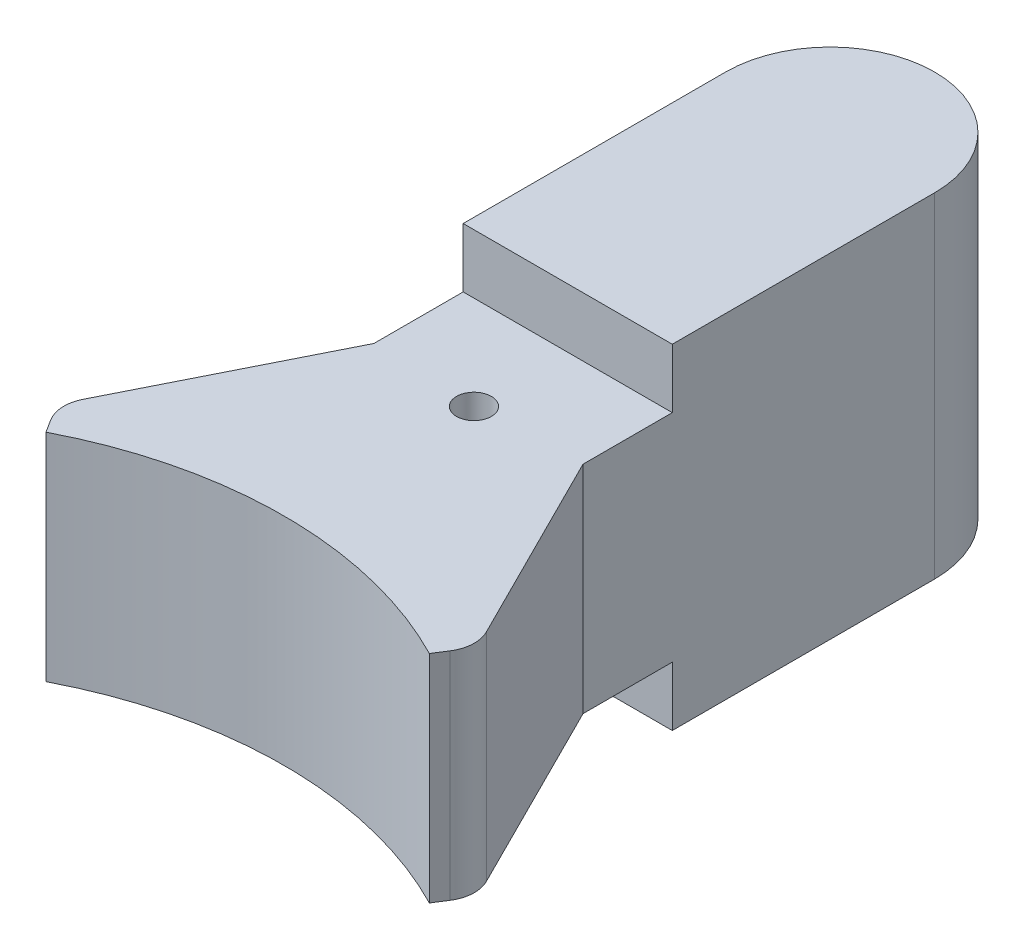
ISO-10303-21;
HEADER;
FILE_DESCRIPTION(('STEP AP214'),'2;1');
FILE_NAME('part.step','',(''),(''),'','','');
FILE_SCHEMA(('AUTOMOTIVE_DESIGN { 1 0 10303 214 1 1 1 1 }'));
ENDSEC;
DATA;
#1=APPLICATION_CONTEXT('core data for automotive mechanical design processes');
#2=APPLICATION_PROTOCOL_DEFINITION('international standard','automotive_design',2000,#1);
#3=PRODUCT_CONTEXT('',#1,'mechanical');
#4=PRODUCT('Part','Part','',(#3));
#5=PRODUCT_RELATED_PRODUCT_CATEGORY('part','',(#4));
#6=PRODUCT_DEFINITION_FORMATION('','',#4);
#7=PRODUCT_DEFINITION_CONTEXT('part definition',#1,'design');
#8=PRODUCT_DEFINITION('design','',#6,#7);
#9=PRODUCT_DEFINITION_SHAPE('','',#8);
#10=(LENGTH_UNIT() NAMED_UNIT(*) SI_UNIT(.MILLI.,.METRE.));
#11=(NAMED_UNIT(*) PLANE_ANGLE_UNIT() SI_UNIT($,.RADIAN.));
#12=(NAMED_UNIT(*) SI_UNIT($,.STERADIAN.) SOLID_ANGLE_UNIT());
#13=UNCERTAINTY_MEASURE_WITH_UNIT(LENGTH_MEASURE(1.E-05),#10,'distance_accuracy_value','');
#14=(GEOMETRIC_REPRESENTATION_CONTEXT(3) GLOBAL_UNCERTAINTY_ASSIGNED_CONTEXT((#13)) GLOBAL_UNIT_ASSIGNED_CONTEXT((#10,
#11,#12)) REPRESENTATION_CONTEXT('',''));
#15=CARTESIAN_POINT('',(0.,0.,0.));
#16=DIRECTION('',(0.,0.,1.));
#17=DIRECTION('',(1.,0.,0.));
#18=AXIS2_PLACEMENT_3D('',#15,#16,#17);
#19=CARTESIAN_POINT('',(0.,4.8,-9.));
#20=DIRECTION('',(0.,-1.,0.));
#21=DIRECTION('',(0.,0.,-1.));
#22=AXIS2_PLACEMENT_3D('',#19,#20,#21);
#23=CYLINDRICAL_SURFACE('',#22,3.);
#24=CARTESIAN_POINT('',(0.,-4.8,-9.));
#25=DIRECTION('',(0.,1.,0.));
#26=DIRECTION('',(0.,0.,1.));
#27=AXIS2_PLACEMENT_3D('',#24,#25,#26);
#28=CIRCLE('',#27,3.);
#29=CARTESIAN_POINT('',(3.,-4.8,-9.));
#30=VERTEX_POINT('',#29);
#31=CARTESIAN_POINT('',(-3.,-4.8,-9.));
#32=VERTEX_POINT('',#31);
#33=EDGE_CURVE('E207',#30,#32,#28,.T.);
#34=ORIENTED_EDGE('',*,*,#33,.T.);
#35=DIRECTION('',(0.,-1.,0.));
#36=VECTOR('',#35,1.);
#37=CARTESIAN_POINT('',(-3.,4.8,-9.));
#38=LINE('',#37,#36);
#39=CARTESIAN_POINT('',(-3.,4.8,-9.));
#40=VERTEX_POINT('',#39);
#41=EDGE_CURVE('E246',#40,#32,#38,.T.);
#42=ORIENTED_EDGE('',*,*,#41,.F.);
#43=CARTESIAN_POINT('',(0.,4.8,-9.));
#44=DIRECTION('',(0.,1.,0.));
#45=DIRECTION('',(0.,0.,1.));
#46=AXIS2_PLACEMENT_3D('',#43,#44,#45);
#47=CIRCLE('',#46,3.);
#48=CARTESIAN_POINT('',(3.,4.8,-9.));
#49=VERTEX_POINT('',#48);
#50=EDGE_CURVE('E208',#49,#40,#47,.T.);
#51=ORIENTED_EDGE('',*,*,#50,.F.);
#52=DIRECTION('',(0.,-1.,0.));
#53=VECTOR('',#52,1.);
#54=CARTESIAN_POINT('',(3.,4.8,-9.));
#55=LINE('',#54,#53);
#56=EDGE_CURVE('E216',#49,#30,#55,.T.);
#57=ORIENTED_EDGE('',*,*,#56,.T.);
#58=EDGE_LOOP('',(#34,#42,#51,#57));
#59=FACE_BOUND('',#58,.T.);
#60=ADVANCED_FACE('F35',(#59),#23,.T.);
#61=CARTESIAN_POINT('',(-3.,4.8,0.));
#62=DIRECTION('',(-1.,0.,0.));
#63=DIRECTION('',(0.,0.,1.));
#64=AXIS2_PLACEMENT_3D('',#61,#62,#63);
#65=PLANE('',#64);
#66=DIRECTION('',(0.,-1.,0.));
#67=VECTOR('',#66,1.);
#68=CARTESIAN_POINT('',(-3.,4.8,-1.47067651188357));
#69=LINE('',#68,#67);
#70=CARTESIAN_POINT('',(-3.,4.8,-1.47067651188357));
#71=VERTEX_POINT('',#70);
#72=CARTESIAN_POINT('',(-3.,3.1,-1.47067651188357));
#73=VERTEX_POINT('',#72);
#74=EDGE_CURVE('E160',#71,#73,#69,.T.);
#75=ORIENTED_EDGE('',*,*,#74,.F.);
#76=DIRECTION('',(0.,0.,-1.));
#77=VECTOR('',#76,1.);
#78=CARTESIAN_POINT('',(-3.,4.8,0.));
#79=LINE('',#78,#77);
#80=EDGE_CURVE('E211',#71,#40,#79,.T.);
#81=ORIENTED_EDGE('',*,*,#80,.T.);
#82=ORIENTED_EDGE('',*,*,#41,.T.);
#83=DIRECTION('',(0.,0.,-1.));
#84=VECTOR('',#83,1.);
#85=CARTESIAN_POINT('',(-3.,-4.8,0.));
#86=LINE('',#85,#84);
#87=CARTESIAN_POINT('',(-3.,-4.8,-1.47067651188357));
#88=VERTEX_POINT('',#87);
#89=EDGE_CURVE('E158',#88,#32,#86,.T.);
#90=ORIENTED_EDGE('',*,*,#89,.F.);
#91=DIRECTION('',(0.,-1.,0.));
#92=VECTOR('',#91,1.);
#93=CARTESIAN_POINT('',(-3.,4.8,-1.47067651188357));
#94=LINE('',#93,#92);
#95=CARTESIAN_POINT('',(-3.,-3.1,-1.47067651188357));
#96=VERTEX_POINT('',#95);
#97=EDGE_CURVE('E58',#96,#88,#94,.T.);
#98=ORIENTED_EDGE('',*,*,#97,.F.);
#99=DIRECTION('',(0.,0.,-1.));
#100=VECTOR('',#99,1.);
#101=CARTESIAN_POINT('',(-3.,-3.1,0.));
#102=LINE('',#101,#100);
#103=CARTESIAN_POINT('',(-3.,-3.1,1.09126139068794));
#104=VERTEX_POINT('',#103);
#105=EDGE_CURVE('E138',#104,#96,#102,.T.);
#106=ORIENTED_EDGE('',*,*,#105,.F.);
#107=DIRECTION('',(0.,-1.,0.));
#108=VECTOR('',#107,1.);
#109=CARTESIAN_POINT('',(-3.,4.8,1.09126139068794));
#110=LINE('',#109,#108);
#111=CARTESIAN_POINT('',(-3.,3.1,1.09126139068794));
#112=VERTEX_POINT('',#111);
#113=EDGE_CURVE('E244',#112,#104,#110,.T.);
#114=ORIENTED_EDGE('',*,*,#113,.F.);
#115=DIRECTION('',(0.,0.,1.));
#116=VECTOR('',#115,1.);
#117=CARTESIAN_POINT('',(-3.,3.1,0.));
#118=LINE('',#117,#116);
#119=EDGE_CURVE('E205',#73,#112,#118,.T.);
#120=ORIENTED_EDGE('',*,*,#119,.F.);
#121=EDGE_LOOP('',(#75,#81,#82,#90,#98,#106,#114,#120));
#122=FACE_BOUND('',#121,.T.);
#123=ADVANCED_FACE('F156',(#122),#65,.T.);
#124=CARTESIAN_POINT('',(-1.96163178305889,4.8,-0.982312023664637));
#125=DIRECTION('',(-0.894154236839368,0.,-0.447759087838771));
#126=DIRECTION('',(-0.447759087838771,0.,0.894154236839368));
#127=AXIS2_PLACEMENT_3D('',#124,#125,#126);
#128=PLANE('',#127);
#129=DIRECTION('',(-0.447759087838771,0.,0.894154236839368));
#130=VECTOR('',#129,1.);
#131=CARTESIAN_POINT('',(-1.96163178305889,3.1,-0.982312023664637));
#132=LINE('',#131,#130);
#133=CARTESIAN_POINT('',(-5.78345363026673,3.1,6.64968984953163));
#134=VERTEX_POINT('',#133);
#135=EDGE_CURVE('E203',#112,#134,#132,.T.);
#136=ORIENTED_EDGE('',*,*,#135,.F.);
#137=ORIENTED_EDGE('',*,*,#113,.T.);
#138=DIRECTION('',(0.447759087838771,0.,-0.894154236839368));
#139=VECTOR('',#138,1.);
#140=CARTESIAN_POINT('',(-1.96163178305889,-3.1,-0.982312023664637));
#141=LINE('',#140,#139);
#142=CARTESIAN_POINT('',(-5.78345363026673,-3.1,6.64968984953163));
#143=VERTEX_POINT('',#142);
#144=EDGE_CURVE('E144',#143,#104,#141,.T.);
#145=ORIENTED_EDGE('',*,*,#144,.F.);
#146=DIRECTION('',(0.,-1.,0.));
#147=VECTOR('',#146,1.);
#148=CARTESIAN_POINT('',(-5.78345363026673,4.8,6.64968984953163));
#149=LINE('',#148,#147);
#150=EDGE_CURVE('E241',#134,#143,#149,.T.);
#151=ORIENTED_EDGE('',*,*,#150,.F.);
#152=EDGE_LOOP('',(#136,#137,#145,#151));
#153=FACE_BOUND('',#152,.T.);
#154=ADVANCED_FACE('F269',(#153),#128,.T.);
#155=CARTESIAN_POINT('',(-4.88929939342736,4.8,7.0974489373704));
#156=DIRECTION('',(0.,-1.,0.));
#157=DIRECTION('',(0.,0.,-1.));
#158=AXIS2_PLACEMENT_3D('',#155,#156,#157);
#159=CYLINDRICAL_SURFACE('',#158,1.);
#160=DIRECTION('',(0.,-1.,0.));
#161=VECTOR('',#160,1.);
#162=CARTESIAN_POINT('',(-5.73269083924024,4.8,7.63474854571722));
#163=LINE('',#162,#161);
#164=CARTESIAN_POINT('',(-5.73269083924024,3.1,7.63474854571722));
#165=VERTEX_POINT('',#164);
#166=CARTESIAN_POINT('',(-5.73269083924024,-3.1,7.63474854571723));
#167=VERTEX_POINT('',#166);
#168=EDGE_CURVE('E238',#165,#167,#163,.T.);
#169=ORIENTED_EDGE('',*,*,#168,.F.);
#170=CARTESIAN_POINT('',(-4.88929939342736,3.1,7.0974489373704));
#171=DIRECTION('',(0.,-1.,0.));
#172=DIRECTION('',(0.,0.,-1.));
#173=AXIS2_PLACEMENT_3D('',#170,#171,#172);
#174=CIRCLE('',#173,1.);
#175=EDGE_CURVE('E201',#134,#165,#174,.F.);
#176=ORIENTED_EDGE('',*,*,#175,.F.);
#177=ORIENTED_EDGE('',*,*,#150,.T.);
#178=CARTESIAN_POINT('',(-4.88929939342736,-3.1,7.0974489373704));
#179=DIRECTION('',(0.,1.,0.));
#180=DIRECTION('',(0.,0.,1.));
#181=AXIS2_PLACEMENT_3D('',#178,#179,#180);
#182=CIRCLE('',#181,1.);
#183=EDGE_CURVE('E182',#167,#143,#182,.F.);
#184=ORIENTED_EDGE('',*,*,#183,.F.);
#185=EDGE_LOOP('',(#169,#176,#177,#184));
#186=FACE_BOUND('',#185,.T.);
#187=ADVANCED_FACE('F306',(#186),#159,.T.);
#188=CARTESIAN_POINT('',(-7.53743136793352,4.8,4.80187336738798));
#189=DIRECTION('',(-0.843391445812886,0.,0.537299608346823));
#190=DIRECTION('',(0.537299608346823,0.,0.843391445812886));
#191=AXIS2_PLACEMENT_3D('',#188,#189,#190);
#192=PLANE('',#191);
#193=DIRECTION('',(0.537299608346823,0.,0.843391445812886));
#194=VECTOR('',#193,1.);
#195=CARTESIAN_POINT('',(-7.53743136793352,3.1,4.80187336738798));
#196=LINE('',#195,#194);
#197=CARTESIAN_POINT('',(-5.5,3.1,8.));
#198=VERTEX_POINT('',#197);
#199=EDGE_CURVE('E199',#165,#198,#196,.T.);
#200=ORIENTED_EDGE('',*,*,#199,.F.);
#201=ORIENTED_EDGE('',*,*,#168,.T.);
#202=DIRECTION('',(-0.537299608346823,0.,-0.843391445812886));
#203=VECTOR('',#202,1.);
#204=CARTESIAN_POINT('',(-7.53743136793352,-3.1,4.80187336738798));
#205=LINE('',#204,#203);
#206=CARTESIAN_POINT('',(-5.5,-3.1,8.));
#207=VERTEX_POINT('',#206);
#208=EDGE_CURVE('E179',#207,#167,#205,.T.);
#209=ORIENTED_EDGE('',*,*,#208,.F.);
#210=DIRECTION('',(0.,-1.,0.));
#211=VECTOR('',#210,1.);
#212=CARTESIAN_POINT('',(-5.5,4.8,8.));
#213=LINE('',#212,#211);
#214=EDGE_CURVE('E235',#198,#207,#213,.T.);
#215=ORIENTED_EDGE('',*,*,#214,.F.);
#216=EDGE_LOOP('',(#200,#201,#209,#215));
#217=FACE_BOUND('',#216,.T.);
#218=ADVANCED_FACE('F302',(#217),#192,.T.);
#219=CARTESIAN_POINT('',(0.,4.8,18.6653645038508));
#220=DIRECTION('',(0.,-1.,0.));
#221=DIRECTION('',(0.,0.,-1.));
#222=AXIS2_PLACEMENT_3D('',#219,#220,#221);
#223=CYLINDRICAL_SURFACE('',#222,12.);
#224=DIRECTION('',(0.,-1.,0.));
#225=VECTOR('',#224,1.);
#226=CARTESIAN_POINT('',(5.5,4.8,8.));
#227=LINE('',#226,#225);
#228=CARTESIAN_POINT('',(5.5,3.1,8.));
#229=VERTEX_POINT('',#228);
#230=CARTESIAN_POINT('',(5.5,-3.1,8.));
#231=VERTEX_POINT('',#230);
#232=EDGE_CURVE('E232',#229,#231,#227,.T.);
#233=ORIENTED_EDGE('',*,*,#232,.F.);
#234=CARTESIAN_POINT('',(0.,3.1,18.6653645038508));
#235=DIRECTION('',(0.,-1.,0.));
#236=DIRECTION('',(0.,0.,-1.));
#237=AXIS2_PLACEMENT_3D('',#234,#235,#236);
#238=CIRCLE('',#237,12.);
#239=EDGE_CURVE('E196',#229,#198,#238,.F.);
#240=ORIENTED_EDGE('',*,*,#239,.T.);
#241=ORIENTED_EDGE('',*,*,#214,.T.);
#242=CARTESIAN_POINT('',(0.,-3.1,18.6653645038508));
#243=DIRECTION('',(0.,1.,0.));
#244=DIRECTION('',(0.,0.,1.));
#245=AXIS2_PLACEMENT_3D('',#242,#243,#244);
#246=CIRCLE('',#245,12.);
#247=EDGE_CURVE('E176',#207,#231,#246,.F.);
#248=ORIENTED_EDGE('',*,*,#247,.T.);
#249=EDGE_LOOP('',(#233,#240,#241,#248));
#250=FACE_BOUND('',#249,.T.);
#251=ADVANCED_FACE('F297',(#250),#223,.F.);
#252=CARTESIAN_POINT('',(7.53743136793352,4.8,4.80187336738798));
#253=DIRECTION('',(-0.843391445812886,0.,-0.537299608346823));
#254=DIRECTION('',(-0.537299608346823,0.,0.843391445812886));
#255=AXIS2_PLACEMENT_3D('',#252,#253,#254);
#256=PLANE('',#255);
#257=DIRECTION('',(0.,-1.,0.));
#258=VECTOR('',#257,1.);
#259=CARTESIAN_POINT('',(5.73269083924024,4.8,7.63474854571722));
#260=LINE('',#259,#258);
#261=CARTESIAN_POINT('',(5.73269083924024,3.1,7.63474854571723));
#262=VERTEX_POINT('',#261);
#263=CARTESIAN_POINT('',(5.73269083924024,-3.1,7.63474854571723));
#264=VERTEX_POINT('',#263);
#265=EDGE_CURVE('E229',#262,#264,#260,.T.);
#266=ORIENTED_EDGE('',*,*,#265,.F.);
#267=DIRECTION('',(-0.537299608346823,0.,0.843391445812886));
#268=VECTOR('',#267,1.);
#269=CARTESIAN_POINT('',(7.53743136793352,3.1,4.80187336738798));
#270=LINE('',#269,#268);
#271=EDGE_CURVE('E193',#262,#229,#270,.T.);
#272=ORIENTED_EDGE('',*,*,#271,.T.);
#273=ORIENTED_EDGE('',*,*,#232,.T.);
#274=DIRECTION('',(0.537299608346823,0.,-0.843391445812886));
#275=VECTOR('',#274,1.);
#276=CARTESIAN_POINT('',(7.53743136793352,-3.1,4.80187336738798));
#277=LINE('',#276,#275);
#278=EDGE_CURVE('E173',#231,#264,#277,.T.);
#279=ORIENTED_EDGE('',*,*,#278,.T.);
#280=EDGE_LOOP('',(#266,#272,#273,#279));
#281=FACE_BOUND('',#280,.T.);
#282=ADVANCED_FACE('F294',(#281),#256,.F.);
#283=CARTESIAN_POINT('',(4.88929939342736,4.8,7.0974489373704));
#284=DIRECTION('',(0.,-1.,0.));
#285=DIRECTION('',(0.,0.,-1.));
#286=AXIS2_PLACEMENT_3D('',#283,#284,#285);
#287=CYLINDRICAL_SURFACE('',#286,1.);
#288=CARTESIAN_POINT('',(4.88929939342736,3.1,7.0974489373704));
#289=DIRECTION('',(0.,-1.,0.));
#290=DIRECTION('',(0.,0.,-1.));
#291=AXIS2_PLACEMENT_3D('',#288,#289,#290);
#292=CIRCLE('',#291,1.);
#293=CARTESIAN_POINT('',(5.78345363026673,3.1,6.64968984953163));
#294=VERTEX_POINT('',#293);
#295=EDGE_CURVE('E191',#294,#262,#292,.T.);
#296=ORIENTED_EDGE('',*,*,#295,.T.);
#297=ORIENTED_EDGE('',*,*,#265,.T.);
#298=CARTESIAN_POINT('',(4.88929939342736,-3.1,7.0974489373704));
#299=DIRECTION('',(0.,1.,0.));
#300=DIRECTION('',(0.,0.,1.));
#301=AXIS2_PLACEMENT_3D('',#298,#299,#300);
#302=CIRCLE('',#301,1.);
#303=CARTESIAN_POINT('',(5.78345363026673,-3.1,6.64968984953163));
#304=VERTEX_POINT('',#303);
#305=EDGE_CURVE('E171',#264,#304,#302,.T.);
#306=ORIENTED_EDGE('',*,*,#305,.T.);
#307=DIRECTION('',(0.,-1.,0.));
#308=VECTOR('',#307,1.);
#309=CARTESIAN_POINT('',(5.78345363026673,4.8,6.64968984953163));
#310=LINE('',#309,#308);
#311=EDGE_CURVE('E226',#294,#304,#310,.T.);
#312=ORIENTED_EDGE('',*,*,#311,.F.);
#313=EDGE_LOOP('',(#296,#297,#306,#312));
#314=FACE_BOUND('',#313,.T.);
#315=ADVANCED_FACE('F290',(#314),#287,.T.);
#316=CARTESIAN_POINT('',(1.96163178305889,4.8,-0.982312023664637));
#317=DIRECTION('',(-0.894154236839368,0.,0.447759087838771));
#318=DIRECTION('',(0.447759087838771,0.,0.894154236839368));
#319=AXIS2_PLACEMENT_3D('',#316,#317,#318);
#320=PLANE('',#319);
#321=DIRECTION('',(0.,-1.,0.));
#322=VECTOR('',#321,1.);
#323=CARTESIAN_POINT('',(3.,4.8,1.09126139068794));
#324=LINE('',#323,#322);
#325=CARTESIAN_POINT('',(3.,3.1,1.09126139068794));
#326=VERTEX_POINT('',#325);
#327=CARTESIAN_POINT('',(3.,-3.1,1.09126139068794));
#328=VERTEX_POINT('',#327);
#329=EDGE_CURVE('E223',#326,#328,#324,.T.);
#330=ORIENTED_EDGE('',*,*,#329,.F.);
#331=DIRECTION('',(0.447759087838771,0.,0.894154236839368));
#332=VECTOR('',#331,1.);
#333=CARTESIAN_POINT('',(1.96163178305889,3.1,-0.982312023664637));
#334=LINE('',#333,#332);
#335=EDGE_CURVE('E188',#326,#294,#334,.T.);
#336=ORIENTED_EDGE('',*,*,#335,.T.);
#337=ORIENTED_EDGE('',*,*,#311,.T.);
#338=DIRECTION('',(-0.447759087838771,0.,-0.894154236839368));
#339=VECTOR('',#338,1.);
#340=CARTESIAN_POINT('',(1.96163178305889,-3.1,-0.982312023664637));
#341=LINE('',#340,#339);
#342=EDGE_CURVE('E168',#304,#328,#341,.T.);
#343=ORIENTED_EDGE('',*,*,#342,.T.);
#344=EDGE_LOOP('',(#330,#336,#337,#343));
#345=FACE_BOUND('',#344,.T.);
#346=ADVANCED_FACE('F287',(#345),#320,.F.);
#347=CARTESIAN_POINT('',(3.,4.8,0.));
#348=DIRECTION('',(-1.,0.,0.));
#349=DIRECTION('',(0.,0.,1.));
#350=AXIS2_PLACEMENT_3D('',#347,#348,#349);
#351=PLANE('',#350);
#352=DIRECTION('',(0.,0.,-1.));
#353=VECTOR('',#352,1.);
#354=CARTESIAN_POINT('',(3.,4.8,0.));
#355=LINE('',#354,#353);
#356=CARTESIAN_POINT('',(3.,4.8,-1.47067651188357));
#357=VERTEX_POINT('',#356);
#358=EDGE_CURVE('E214',#357,#49,#355,.T.);
#359=ORIENTED_EDGE('',*,*,#358,.F.);
#360=DIRECTION('',(0.,-1.,0.));
#361=VECTOR('',#360,1.);
#362=CARTESIAN_POINT('',(3.,4.8,-1.47067651188357));
#363=LINE('',#362,#361);
#364=CARTESIAN_POINT('',(3.,3.1,-1.47067651188357));
#365=VERTEX_POINT('',#364);
#366=EDGE_CURVE('E50',#357,#365,#363,.T.);
#367=ORIENTED_EDGE('',*,*,#366,.T.);
#368=DIRECTION('',(0.,0.,1.));
#369=VECTOR('',#368,1.);
#370=CARTESIAN_POINT('',(3.,3.1,0.));
#371=LINE('',#370,#369);
#372=EDGE_CURVE('E185',#365,#326,#371,.T.);
#373=ORIENTED_EDGE('',*,*,#372,.T.);
#374=ORIENTED_EDGE('',*,*,#329,.T.);
#375=DIRECTION('',(0.,0.,-1.));
#376=VECTOR('',#375,1.);
#377=CARTESIAN_POINT('',(3.,-3.1,0.));
#378=LINE('',#377,#376);
#379=CARTESIAN_POINT('',(3.,-3.1,-1.47067651188357));
#380=VERTEX_POINT('',#379);
#381=EDGE_CURVE('E166',#328,#380,#378,.T.);
#382=ORIENTED_EDGE('',*,*,#381,.T.);
#383=DIRECTION('',(0.,-1.,0.));
#384=VECTOR('',#383,1.);
#385=CARTESIAN_POINT('',(3.,4.8,-1.47067651188357));
#386=LINE('',#385,#384);
#387=CARTESIAN_POINT('',(3.,-4.8,-1.47067651188357));
#388=VERTEX_POINT('',#387);
#389=EDGE_CURVE('E151',#380,#388,#386,.T.);
#390=ORIENTED_EDGE('',*,*,#389,.T.);
#391=DIRECTION('',(0.,0.,-1.));
#392=VECTOR('',#391,1.);
#393=CARTESIAN_POINT('',(3.,-4.8,0.));
#394=LINE('',#393,#392);
#395=EDGE_CURVE('E212',#388,#30,#394,.T.);
#396=ORIENTED_EDGE('',*,*,#395,.T.);
#397=ORIENTED_EDGE('',*,*,#56,.F.);
#398=EDGE_LOOP('',(#359,#367,#373,#374,#382,#390,#396,#397));
#399=FACE_BOUND('',#398,.T.);
#400=ADVANCED_FACE('F283',(#399),#351,.F.);
#401=CARTESIAN_POINT('',(0.,4.8,0.));
#402=DIRECTION('',(0.,1.,0.));
#403=DIRECTION('',(0.,0.,1.));
#404=AXIS2_PLACEMENT_3D('',#401,#402,#403);
#405=PLANE('',#404);
#406=DIRECTION('',(-1.,0.,0.));
#407=VECTOR('',#406,1.);
#408=CARTESIAN_POINT('',(0.,4.8,-1.47067651188357));
#409=LINE('',#408,#407);
#410=EDGE_CURVE('E11',#357,#71,#409,.T.);
#411=ORIENTED_EDGE('',*,*,#410,.F.);
#412=ORIENTED_EDGE('',*,*,#358,.T.);
#413=ORIENTED_EDGE('',*,*,#50,.T.);
#414=ORIENTED_EDGE('',*,*,#80,.F.);
#415=EDGE_LOOP('',(#411,#412,#413,#414));
#416=FACE_BOUND('',#415,.T.);
#417=ADVANCED_FACE('F280',(#416),#405,.T.);
#418=CARTESIAN_POINT('',(0.,-4.8,0.));
#419=DIRECTION('',(0.,1.,0.));
#420=DIRECTION('',(0.,0.,1.));
#421=AXIS2_PLACEMENT_3D('',#418,#419,#420);
#422=PLANE('',#421);
#423=ORIENTED_EDGE('',*,*,#395,.F.);
#424=DIRECTION('',(-1.,0.,0.));
#425=VECTOR('',#424,1.);
#426=CARTESIAN_POINT('',(0.,-4.8,-1.47067651188357));
#427=LINE('',#426,#425);
#428=EDGE_CURVE('E43',#388,#88,#427,.T.);
#429=ORIENTED_EDGE('',*,*,#428,.T.);
#430=ORIENTED_EDGE('',*,*,#89,.T.);
#431=ORIENTED_EDGE('',*,*,#33,.F.);
#432=EDGE_LOOP('',(#423,#429,#430,#431));
#433=FACE_BOUND('',#432,.T.);
#434=ADVANCED_FACE('F276',(#433),#422,.F.);
#435=CARTESIAN_POINT('',(-5.88929939342736,-3.1,-1.47067651188357));
#436=DIRECTION('',(0.,1.,0.));
#437=DIRECTION('',(0.,0.,1.));
#438=AXIS2_PLACEMENT_3D('',#435,#436,#437);
#439=PLANE('',#438);
#440=ORIENTED_EDGE('',*,*,#105,.T.);
#441=DIRECTION('',(1.,0.,0.));
#442=VECTOR('',#441,1.);
#443=CARTESIAN_POINT('',(-5.88929939342736,-3.1,-1.47067651188357));
#444=LINE('',#443,#442);
#445=EDGE_CURVE('E141',#96,#380,#444,.T.);
#446=ORIENTED_EDGE('',*,*,#445,.T.);
#447=ORIENTED_EDGE('',*,*,#381,.F.);
#448=ORIENTED_EDGE('',*,*,#342,.F.);
#449=ORIENTED_EDGE('',*,*,#305,.F.);
#450=ORIENTED_EDGE('',*,*,#278,.F.);
#451=ORIENTED_EDGE('',*,*,#247,.F.);
#452=ORIENTED_EDGE('',*,*,#208,.T.);
#453=ORIENTED_EDGE('',*,*,#183,.T.);
#454=ORIENTED_EDGE('',*,*,#144,.T.);
#455=EDGE_LOOP('',(#440,#446,#447,#448,#449,#450,#451,#452,#453,#454));
#456=FACE_BOUND('',#455,.T.);
#457=CARTESIAN_POINT('',(0.,-3.1,1.22));
#458=DIRECTION('',(0.,1.,0.));
#459=DIRECTION('',(0.,0.,1.));
#460=AXIS2_PLACEMENT_3D('',#457,#458,#459);
#461=CIRCLE('',#460,0.5);
#462=CARTESIAN_POINT('',(0.,-3.1,1.72));
#463=VERTEX_POINT('',#462);
#464=EDGE_CURVE('E165',#463,#463,#461,.T.);
#465=ORIENTED_EDGE('',*,*,#464,.T.);
#466=EDGE_LOOP('',(#465));
#467=FACE_BOUND('',#466,.T.);
#468=ADVANCED_FACE('F139',(#456,#467),#439,.F.);
#469=CARTESIAN_POINT('',(-5.88929939342736,-6.93963709828471,-1.47067651188357));
#470=DIRECTION('',(0.,0.,-1.));
#471=DIRECTION('',(0.,1.,0.));
#472=AXIS2_PLACEMENT_3D('',#469,#470,#471);
#473=PLANE('',#472);
#474=ORIENTED_EDGE('',*,*,#97,.T.);
#475=ORIENTED_EDGE('',*,*,#428,.F.);
#476=ORIENTED_EDGE('',*,*,#389,.F.);
#477=ORIENTED_EDGE('',*,*,#445,.F.);
#478=EDGE_LOOP('',(#474,#475,#476,#477));
#479=FACE_BOUND('',#478,.T.);
#480=ADVANCED_FACE('F149',(#479),#473,.F.);
#481=CARTESIAN_POINT('',(-5.88929939342736,3.1,-1.47067651188357));
#482=DIRECTION('',(0.,-1.,0.));
#483=DIRECTION('',(0.,0.,-1.));
#484=AXIS2_PLACEMENT_3D('',#481,#482,#483);
#485=PLANE('',#484);
#486=ORIENTED_EDGE('',*,*,#119,.T.);
#487=ORIENTED_EDGE('',*,*,#135,.T.);
#488=ORIENTED_EDGE('',*,*,#175,.T.);
#489=ORIENTED_EDGE('',*,*,#199,.T.);
#490=ORIENTED_EDGE('',*,*,#239,.F.);
#491=ORIENTED_EDGE('',*,*,#271,.F.);
#492=ORIENTED_EDGE('',*,*,#295,.F.);
#493=ORIENTED_EDGE('',*,*,#335,.F.);
#494=ORIENTED_EDGE('',*,*,#372,.F.);
#495=DIRECTION('',(1.,0.,0.));
#496=VECTOR('',#495,1.);
#497=CARTESIAN_POINT('',(-5.88929939342736,3.1,-1.47067651188357));
#498=LINE('',#497,#496);
#499=EDGE_CURVE('E152',#73,#365,#498,.T.);
#500=ORIENTED_EDGE('',*,*,#499,.F.);
#501=EDGE_LOOP('',(#486,#487,#488,#489,#490,#491,#492,#493,#494,#500));
#502=FACE_BOUND('',#501,.T.);
#503=CARTESIAN_POINT('',(0.,3.1,1.22));
#504=DIRECTION('',(0.,-1.,0.));
#505=DIRECTION('',(0.,0.,-1.));
#506=AXIS2_PLACEMENT_3D('',#503,#504,#505);
#507=CIRCLE('',#506,0.5);
#508=CARTESIAN_POINT('',(0.,3.1,0.72));
#509=VERTEX_POINT('',#508);
#510=EDGE_CURVE('E38',#509,#509,#507,.T.);
#511=ORIENTED_EDGE('',*,*,#510,.T.);
#512=EDGE_LOOP('',(#511));
#513=FACE_BOUND('',#512,.T.);
#514=ADVANCED_FACE('F259',(#502,#513),#485,.F.);
#515=CARTESIAN_POINT('',(-5.88929939342736,6.14870061736463,-1.47067651188357));
#516=DIRECTION('',(0.,0.,-1.));
#517=DIRECTION('',(0.,1.,0.));
#518=AXIS2_PLACEMENT_3D('',#515,#516,#517);
#519=PLANE('',#518);
#520=ORIENTED_EDGE('',*,*,#74,.T.);
#521=ORIENTED_EDGE('',*,*,#499,.T.);
#522=ORIENTED_EDGE('',*,*,#366,.F.);
#523=ORIENTED_EDGE('',*,*,#410,.T.);
#524=EDGE_LOOP('',(#520,#521,#522,#523));
#525=FACE_BOUND('',#524,.T.);
#526=ADVANCED_FACE('F253',(#525),#519,.F.);
#527=CARTESIAN_POINT('',(0.,4.8,1.22));
#528=DIRECTION('',(0.,-1.,0.));
#529=DIRECTION('',(0.,0.,-1.));
#530=AXIS2_PLACEMENT_3D('',#527,#528,#529);
#531=CYLINDRICAL_SURFACE('',#530,0.5);
#532=ORIENTED_EDGE('',*,*,#510,.F.);
#533=EDGE_LOOP('',(#532));
#534=FACE_BOUND('',#533,.T.);
#535=ORIENTED_EDGE('',*,*,#464,.F.);
#536=EDGE_LOOP('',(#535));
#537=FACE_BOUND('',#536,.T.);
#538=ADVANCED_FACE('F251',(#534,#537),#531,.F.);
#539=CLOSED_SHELL('',(#60,#123,#154,#187,#218,#251,#282,#315,#346,#400,#417,#434,#468,#480,#514,
#526,#538));
#540=MANIFOLD_SOLID_BREP('B2',#539);
#541=ADVANCED_BREP_SHAPE_REPRESENTATION('',(#18,#540),#14);
#542=SHAPE_DEFINITION_REPRESENTATION(#9,#541);
ENDSEC;
END-ISO-10303-21;
